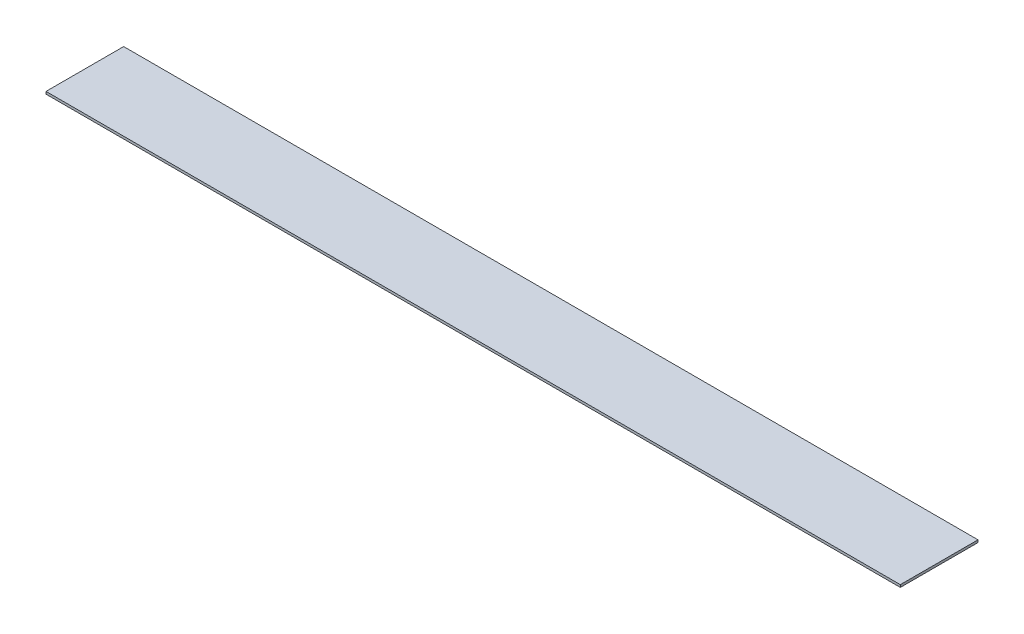
ISO-10303-21;
HEADER;
FILE_DESCRIPTION(('STEP AP214'),'2;1');
FILE_NAME('part.step','',(''),(''),'','','');
FILE_SCHEMA(('AUTOMOTIVE_DESIGN { 1 0 10303 214 1 1 1 1 }'));
ENDSEC;
DATA;
#1=APPLICATION_CONTEXT('core data for automotive mechanical design processes');
#2=APPLICATION_PROTOCOL_DEFINITION('international standard','automotive_design',2000,#1);
#3=PRODUCT_CONTEXT('',#1,'mechanical');
#4=PRODUCT('Part','Part','',(#3));
#5=PRODUCT_RELATED_PRODUCT_CATEGORY('part','',(#4));
#6=PRODUCT_DEFINITION_FORMATION('','',#4);
#7=PRODUCT_DEFINITION_CONTEXT('part definition',#1,'design');
#8=PRODUCT_DEFINITION('design','',#6,#7);
#9=PRODUCT_DEFINITION_SHAPE('','',#8);
#10=(LENGTH_UNIT() NAMED_UNIT(*) SI_UNIT(.MILLI.,.METRE.));
#11=(NAMED_UNIT(*) PLANE_ANGLE_UNIT() SI_UNIT($,.RADIAN.));
#12=(NAMED_UNIT(*) SI_UNIT($,.STERADIAN.) SOLID_ANGLE_UNIT());
#13=UNCERTAINTY_MEASURE_WITH_UNIT(LENGTH_MEASURE(1.E-05),#10,'distance_accuracy_value','');
#14=(GEOMETRIC_REPRESENTATION_CONTEXT(3) GLOBAL_UNCERTAINTY_ASSIGNED_CONTEXT((#13)) GLOBAL_UNIT_ASSIGNED_CONTEXT((#10,
#11,#12)) REPRESENTATION_CONTEXT('',''));
#15=CARTESIAN_POINT('',(0.,0.,0.));
#16=DIRECTION('',(0.,0.,1.));
#17=DIRECTION('',(1.,0.,0.));
#18=AXIS2_PLACEMENT_3D('',#15,#16,#17);
#19=CARTESIAN_POINT('',(0.,-81.849866020411,0.));
#20=DIRECTION('',(1.,0.,0.));
#21=DIRECTION('',(0.,0.,-1.));
#22=AXIS2_PLACEMENT_3D('',#19,#20,#21);
#23=PLANE('',#22);
#24=DIRECTION('',(0.,0.,-1.));
#25=VECTOR('',#24,1.);
#26=CARTESIAN_POINT('',(0.,-80.262366020411,0.));
#27=LINE('',#26,#25);
#28=CARTESIAN_POINT('',(0.,-80.262366020411,50.8));
#29=VERTEX_POINT('',#28);
#30=CARTESIAN_POINT('',(0.,-80.262366020411,0.));
#31=VERTEX_POINT('',#30);
#32=EDGE_CURVE('E99',#29,#31,#27,.T.);
#33=ORIENTED_EDGE('',*,*,#32,.T.);
#34=DIRECTION('',(0.,1.,0.));
#35=VECTOR('',#34,1.);
#36=CARTESIAN_POINT('',(0.,-81.849866020411,0.));
#37=LINE('',#36,#35);
#38=CARTESIAN_POINT('',(0.,-81.849866020411,0.));
#39=VERTEX_POINT('',#38);
#40=EDGE_CURVE('E11',#39,#31,#37,.T.);
#41=ORIENTED_EDGE('',*,*,#40,.F.);
#42=DIRECTION('',(0.,0.,-1.));
#43=VECTOR('',#42,1.);
#44=CARTESIAN_POINT('',(0.,-81.849866020411,0.));
#45=LINE('',#44,#43);
#46=CARTESIAN_POINT('',(0.,-81.849866020411,50.8));
#47=VERTEX_POINT('',#46);
#48=EDGE_CURVE('E87',#47,#39,#45,.T.);
#49=ORIENTED_EDGE('',*,*,#48,.F.);
#50=DIRECTION('',(0.,1.,0.));
#51=VECTOR('',#50,1.);
#52=CARTESIAN_POINT('',(0.,-81.849866020411,50.8));
#53=LINE('',#52,#51);
#54=EDGE_CURVE('E95',#47,#29,#53,.T.);
#55=ORIENTED_EDGE('',*,*,#54,.T.);
#56=EDGE_LOOP('',(#33,#41,#49,#55));
#57=FACE_BOUND('',#56,.T.);
#58=ADVANCED_FACE('F36',(#57),#23,.F.);
#59=CARTESIAN_POINT('',(0.,-81.849866020411,0.));
#60=DIRECTION('',(0.,0.,1.));
#61=DIRECTION('',(1.,0.,0.));
#62=AXIS2_PLACEMENT_3D('',#59,#60,#61);
#63=PLANE('',#62);
#64=DIRECTION('',(1.,0.,0.));
#65=VECTOR('',#64,1.);
#66=CARTESIAN_POINT('',(0.,-80.262366020411,0.));
#67=LINE('',#66,#65);
#68=CARTESIAN_POINT('',(558.8,-80.262366020411,0.));
#69=VERTEX_POINT('',#68);
#70=EDGE_CURVE('E91',#31,#69,#67,.T.);
#71=ORIENTED_EDGE('',*,*,#70,.T.);
#72=DIRECTION('',(0.,1.,0.));
#73=VECTOR('',#72,1.);
#74=CARTESIAN_POINT('',(558.8,-81.849866020411,0.));
#75=LINE('',#74,#73);
#76=CARTESIAN_POINT('',(558.8,-81.849866020411,0.));
#77=VERTEX_POINT('',#76);
#78=EDGE_CURVE('E44',#77,#69,#75,.T.);
#79=ORIENTED_EDGE('',*,*,#78,.F.);
#80=DIRECTION('',(1.,0.,0.));
#81=VECTOR('',#80,1.);
#82=CARTESIAN_POINT('',(0.,-81.849866020411,0.));
#83=LINE('',#82,#81);
#84=EDGE_CURVE('E82',#39,#77,#83,.T.);
#85=ORIENTED_EDGE('',*,*,#84,.F.);
#86=ORIENTED_EDGE('',*,*,#40,.T.);
#87=EDGE_LOOP('',(#71,#79,#85,#86));
#88=FACE_BOUND('',#87,.T.);
#89=ADVANCED_FACE('F90',(#88),#63,.F.);
#90=CARTESIAN_POINT('',(558.8,-81.849866020411,0.));
#91=DIRECTION('',(-1.,0.,0.));
#92=DIRECTION('',(0.,0.,1.));
#93=AXIS2_PLACEMENT_3D('',#90,#91,#92);
#94=PLANE('',#93);
#95=DIRECTION('',(0.,0.,1.));
#96=VECTOR('',#95,1.);
#97=CARTESIAN_POINT('',(558.8,-80.262366020411,0.));
#98=LINE('',#97,#96);
#99=CARTESIAN_POINT('',(558.8,-80.262366020411,50.8));
#100=VERTEX_POINT('',#99);
#101=EDGE_CURVE('E69',#69,#100,#98,.T.);
#102=ORIENTED_EDGE('',*,*,#101,.T.);
#103=DIRECTION('',(0.,1.,0.));
#104=VECTOR('',#103,1.);
#105=CARTESIAN_POINT('',(558.8,-81.849866020411,50.8));
#106=LINE('',#105,#104);
#107=CARTESIAN_POINT('',(558.8,-81.849866020411,50.8));
#108=VERTEX_POINT('',#107);
#109=EDGE_CURVE('E92',#108,#100,#106,.T.);
#110=ORIENTED_EDGE('',*,*,#109,.F.);
#111=DIRECTION('',(0.,0.,1.));
#112=VECTOR('',#111,1.);
#113=CARTESIAN_POINT('',(558.8,-81.849866020411,0.));
#114=LINE('',#113,#112);
#115=EDGE_CURVE('E85',#77,#108,#114,.T.);
#116=ORIENTED_EDGE('',*,*,#115,.F.);
#117=ORIENTED_EDGE('',*,*,#78,.T.);
#118=EDGE_LOOP('',(#102,#110,#116,#117));
#119=FACE_BOUND('',#118,.T.);
#120=ADVANCED_FACE('F93',(#119),#94,.F.);
#121=CARTESIAN_POINT('',(0.,-81.849866020411,50.8));
#122=DIRECTION('',(0.,0.,-1.));
#123=DIRECTION('',(-1.,0.,0.));
#124=AXIS2_PLACEMENT_3D('',#121,#122,#123);
#125=PLANE('',#124);
#126=DIRECTION('',(-1.,0.,0.));
#127=VECTOR('',#126,1.);
#128=CARTESIAN_POINT('',(0.,-80.262366020411,50.8));
#129=LINE('',#128,#127);
#130=EDGE_CURVE('E75',#100,#29,#129,.T.);
#131=ORIENTED_EDGE('',*,*,#130,.T.);
#132=ORIENTED_EDGE('',*,*,#54,.F.);
#133=DIRECTION('',(-1.,0.,0.));
#134=VECTOR('',#133,1.);
#135=CARTESIAN_POINT('',(0.,-81.849866020411,50.8));
#136=LINE('',#135,#134);
#137=EDGE_CURVE('E52',#108,#47,#136,.T.);
#138=ORIENTED_EDGE('',*,*,#137,.F.);
#139=ORIENTED_EDGE('',*,*,#109,.T.);
#140=EDGE_LOOP('',(#131,#132,#138,#139));
#141=FACE_BOUND('',#140,.T.);
#142=ADVANCED_FACE('F106',(#141),#125,.F.);
#143=CARTESIAN_POINT('',(0.,-81.849866020411,0.));
#144=DIRECTION('',(0.,1.,0.));
#145=DIRECTION('',(0.,0.,1.));
#146=AXIS2_PLACEMENT_3D('',#143,#144,#145);
#147=PLANE('',#146);
#148=ORIENTED_EDGE('',*,*,#48,.T.);
#149=ORIENTED_EDGE('',*,*,#84,.T.);
#150=ORIENTED_EDGE('',*,*,#115,.T.);
#151=ORIENTED_EDGE('',*,*,#137,.T.);
#152=EDGE_LOOP('',(#148,#149,#150,#151));
#153=FACE_BOUND('',#152,.T.);
#154=ADVANCED_FACE('F83',(#153),#147,.F.);
#155=CARTESIAN_POINT('',(0.,-80.262366020411,0.));
#156=DIRECTION('',(0.,1.,0.));
#157=DIRECTION('',(0.,0.,1.));
#158=AXIS2_PLACEMENT_3D('',#155,#156,#157);
#159=PLANE('',#158);
#160=ORIENTED_EDGE('',*,*,#32,.F.);
#161=ORIENTED_EDGE('',*,*,#130,.F.);
#162=ORIENTED_EDGE('',*,*,#101,.F.);
#163=ORIENTED_EDGE('',*,*,#70,.F.);
#164=EDGE_LOOP('',(#160,#161,#162,#163));
#165=FACE_BOUND('',#164,.T.);
#166=ADVANCED_FACE('F109',(#165),#159,.T.);
#167=CLOSED_SHELL('',(#58,#89,#120,#142,#154,#166));
#168=MANIFOLD_SOLID_BREP('B2',#167);
#169=ADVANCED_BREP_SHAPE_REPRESENTATION('',(#18,#168),#14);
#170=SHAPE_DEFINITION_REPRESENTATION(#9,#169);
ENDSEC;
END-ISO-10303-21;
